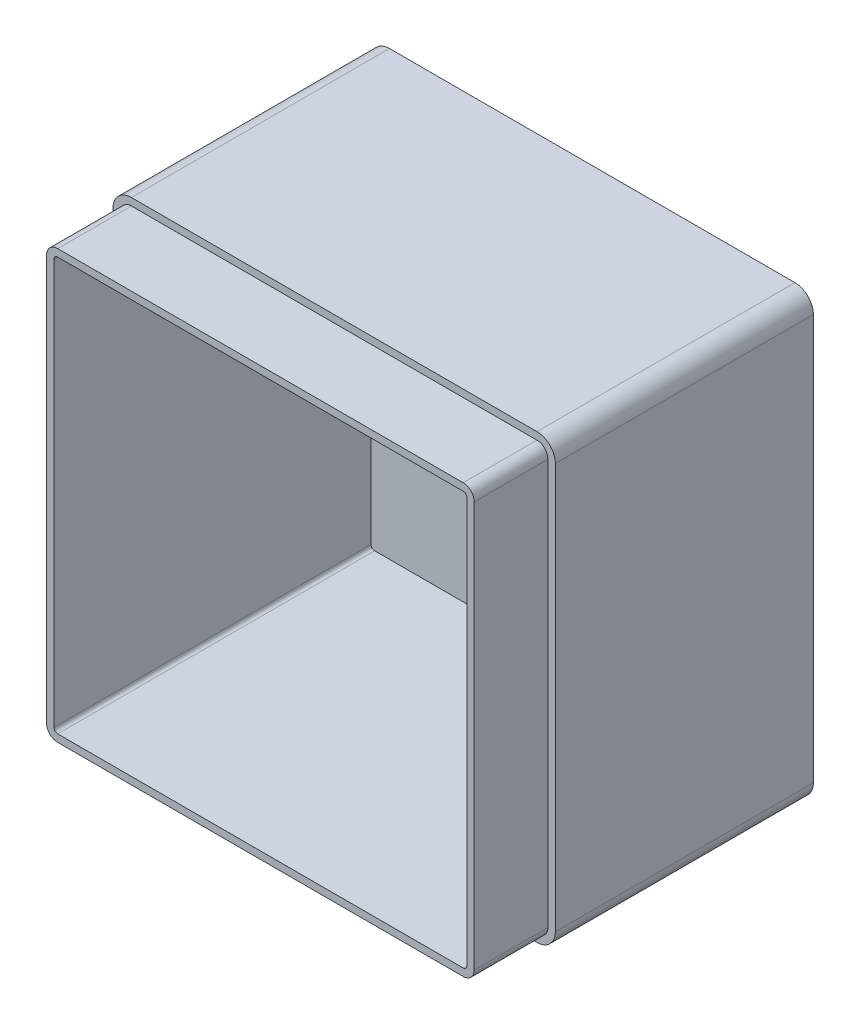
ISO-10303-21;
HEADER;
FILE_DESCRIPTION(('STEP AP214'),'2;1');
FILE_NAME('part.step','',(''),(''),'','','');
FILE_SCHEMA(('AUTOMOTIVE_DESIGN { 1 0 10303 214 1 1 1 1 }'));
ENDSEC;
DATA;
#1=APPLICATION_CONTEXT('core data for automotive mechanical design processes');
#2=APPLICATION_PROTOCOL_DEFINITION('international standard','automotive_design',2000,#1);
#3=PRODUCT_CONTEXT('',#1,'mechanical');
#4=PRODUCT('Part','Part','',(#3));
#5=PRODUCT_RELATED_PRODUCT_CATEGORY('part','',(#4));
#6=PRODUCT_DEFINITION_FORMATION('','',#4);
#7=PRODUCT_DEFINITION_CONTEXT('part definition',#1,'design');
#8=PRODUCT_DEFINITION('design','',#6,#7);
#9=PRODUCT_DEFINITION_SHAPE('','',#8);
#10=(LENGTH_UNIT() NAMED_UNIT(*) SI_UNIT(.MILLI.,.METRE.));
#11=(NAMED_UNIT(*) PLANE_ANGLE_UNIT() SI_UNIT($,.RADIAN.));
#12=(NAMED_UNIT(*) SI_UNIT($,.STERADIAN.) SOLID_ANGLE_UNIT());
#13=UNCERTAINTY_MEASURE_WITH_UNIT(LENGTH_MEASURE(1.E-05),#10,'distance_accuracy_value','');
#14=(GEOMETRIC_REPRESENTATION_CONTEXT(3) GLOBAL_UNCERTAINTY_ASSIGNED_CONTEXT((#13)) GLOBAL_UNIT_ASSIGNED_CONTEXT((#10,
#11,#12)) REPRESENTATION_CONTEXT('',''));
#15=CARTESIAN_POINT('',(0.,0.,0.));
#16=DIRECTION('',(0.,0.,1.));
#17=DIRECTION('',(1.,0.,0.));
#18=AXIS2_PLACEMENT_3D('',#15,#16,#17);
#19=CARTESIAN_POINT('',(0.,0.,90.));
#20=DIRECTION('',(0.,0.,1.));
#21=DIRECTION('',(1.,0.,0.));
#22=AXIS2_PLACEMENT_3D('',#19,#20,#21);
#23=PLANE('',#22);
#24=DIRECTION('',(0.,-1.,0.));
#25=VECTOR('',#24,1.);
#26=CARTESIAN_POINT('',(4.,0.,90.));
#27=LINE('',#26,#25);
#28=CARTESIAN_POINT('',(4.,-4.99999999999999,90.));
#29=VERTEX_POINT('',#28);
#30=CARTESIAN_POINT('',(4.,-115.,90.));
#31=VERTEX_POINT('',#30);
#32=EDGE_CURVE('E304',#29,#31,#27,.T.);
#33=ORIENTED_EDGE('',*,*,#32,.F.);
#34=CARTESIAN_POINT('',(5.,-5.,90.));
#35=DIRECTION('',(0.,0.,1.));
#36=DIRECTION('',(1.,0.,0.));
#37=AXIS2_PLACEMENT_3D('',#34,#35,#36);
#38=CIRCLE('',#37,1.);
#39=CARTESIAN_POINT('',(5.,-4.,90.));
#40=VERTEX_POINT('',#39);
#41=EDGE_CURVE('E333',#40,#29,#38,.T.);
#42=ORIENTED_EDGE('',*,*,#41,.F.);
#43=DIRECTION('',(-1.,0.,0.));
#44=VECTOR('',#43,1.);
#45=CARTESIAN_POINT('',(0.,-4.,90.));
#46=LINE('',#45,#44);
#47=CARTESIAN_POINT('',(115.,-4.,90.));
#48=VERTEX_POINT('',#47);
#49=EDGE_CURVE('E315',#48,#40,#46,.T.);
#50=ORIENTED_EDGE('',*,*,#49,.F.);
#51=CARTESIAN_POINT('',(115.,-5.,90.));
#52=DIRECTION('',(0.,0.,1.));
#53=DIRECTION('',(1.,0.,0.));
#54=AXIS2_PLACEMENT_3D('',#51,#52,#53);
#55=CIRCLE('',#54,1.);
#56=CARTESIAN_POINT('',(116.,-5.,90.));
#57=VERTEX_POINT('',#56);
#58=EDGE_CURVE('E338',#57,#48,#55,.T.);
#59=ORIENTED_EDGE('',*,*,#58,.F.);
#60=DIRECTION('',(0.,1.,0.));
#61=VECTOR('',#60,1.);
#62=CARTESIAN_POINT('',(116.,0.,90.));
#63=LINE('',#62,#61);
#64=CARTESIAN_POINT('',(116.,-115.,90.));
#65=VERTEX_POINT('',#64);
#66=EDGE_CURVE('E336',#65,#57,#63,.T.);
#67=ORIENTED_EDGE('',*,*,#66,.F.);
#68=CARTESIAN_POINT('',(115.,-115.,90.));
#69=DIRECTION('',(0.,0.,1.));
#70=DIRECTION('',(1.,0.,0.));
#71=AXIS2_PLACEMENT_3D('',#68,#69,#70);
#72=CIRCLE('',#71,1.);
#73=CARTESIAN_POINT('',(115.,-116.,90.));
#74=VERTEX_POINT('',#73);
#75=EDGE_CURVE('E289',#74,#65,#72,.T.);
#76=ORIENTED_EDGE('',*,*,#75,.F.);
#77=DIRECTION('',(1.,0.,0.));
#78=VECTOR('',#77,1.);
#79=CARTESIAN_POINT('',(0.,-116.,90.));
#80=LINE('',#79,#78);
#81=CARTESIAN_POINT('',(5.,-116.,90.));
#82=VERTEX_POINT('',#81);
#83=EDGE_CURVE('E331',#82,#74,#80,.T.);
#84=ORIENTED_EDGE('',*,*,#83,.F.);
#85=CARTESIAN_POINT('',(5.,-115.,90.));
#86=DIRECTION('',(0.,0.,1.));
#87=DIRECTION('',(1.,0.,0.));
#88=AXIS2_PLACEMENT_3D('',#85,#86,#87);
#89=CIRCLE('',#88,1.);
#90=EDGE_CURVE('E326',#31,#82,#89,.T.);
#91=ORIENTED_EDGE('',*,*,#90,.F.);
#92=EDGE_LOOP('',(#33,#42,#50,#59,#67,#76,#84,#91));
#93=FACE_BOUND('',#92,.T.);
#94=DIRECTION('',(-1.,0.,0.));
#95=VECTOR('',#94,1.);
#96=CARTESIAN_POINT('',(115.,-2.,90.));
#97=LINE('',#96,#95);
#98=CARTESIAN_POINT('',(115.,-1.99999999999997,90.));
#99=VERTEX_POINT('',#98);
#100=CARTESIAN_POINT('',(5.,-2.00000000000002,90.));
#101=VERTEX_POINT('',#100);
#102=EDGE_CURVE('E221',#99,#101,#97,.T.);
#103=ORIENTED_EDGE('',*,*,#102,.T.);
#104=CARTESIAN_POINT('',(5.,-5.,90.));
#105=DIRECTION('',(0.,0.,1.));
#106=DIRECTION('',(1.,0.,0.));
#107=AXIS2_PLACEMENT_3D('',#104,#105,#106);
#108=CIRCLE('',#107,2.99999999999999);
#109=CARTESIAN_POINT('',(2.,-5.,90.));
#110=VERTEX_POINT('',#109);
#111=EDGE_CURVE('E241',#101,#110,#108,.T.);
#112=ORIENTED_EDGE('',*,*,#111,.T.);
#113=DIRECTION('',(0.,-1.,0.));
#114=VECTOR('',#113,1.);
#115=CARTESIAN_POINT('',(2.,-5.,90.));
#116=LINE('',#115,#114);
#117=CARTESIAN_POINT('',(2.00000000000001,-115.,90.));
#118=VERTEX_POINT('',#117);
#119=EDGE_CURVE('E201',#110,#118,#116,.T.);
#120=ORIENTED_EDGE('',*,*,#119,.T.);
#121=CARTESIAN_POINT('',(5.,-115.,90.));
#122=DIRECTION('',(0.,0.,1.));
#123=DIRECTION('',(1.,0.,0.));
#124=AXIS2_PLACEMENT_3D('',#121,#122,#123);
#125=CIRCLE('',#124,2.99999999999999);
#126=CARTESIAN_POINT('',(5.,-118.,90.));
#127=VERTEX_POINT('',#126);
#128=EDGE_CURVE('E49',#118,#127,#125,.T.);
#129=ORIENTED_EDGE('',*,*,#128,.T.);
#130=DIRECTION('',(1.,0.,0.));
#131=VECTOR('',#130,1.);
#132=CARTESIAN_POINT('',(5.,-118.,90.));
#133=LINE('',#132,#131);
#134=CARTESIAN_POINT('',(115.,-118.,90.));
#135=VERTEX_POINT('',#134);
#136=EDGE_CURVE('E245',#127,#135,#133,.T.);
#137=ORIENTED_EDGE('',*,*,#136,.T.);
#138=CARTESIAN_POINT('',(115.,-115.,90.));
#139=DIRECTION('',(0.,0.,1.));
#140=DIRECTION('',(1.,0.,0.));
#141=AXIS2_PLACEMENT_3D('',#138,#139,#140);
#142=CIRCLE('',#141,3.);
#143=CARTESIAN_POINT('',(118.,-115.,90.));
#144=VERTEX_POINT('',#143);
#145=EDGE_CURVE('E248',#135,#144,#142,.T.);
#146=ORIENTED_EDGE('',*,*,#145,.T.);
#147=DIRECTION('',(0.,1.,0.));
#148=VECTOR('',#147,1.);
#149=CARTESIAN_POINT('',(118.,-115.,90.));
#150=LINE('',#149,#148);
#151=CARTESIAN_POINT('',(118.,-4.99999999999999,90.));
#152=VERTEX_POINT('',#151);
#153=EDGE_CURVE('E251',#144,#152,#150,.T.);
#154=ORIENTED_EDGE('',*,*,#153,.T.);
#155=CARTESIAN_POINT('',(115.,-5.,90.));
#156=DIRECTION('',(0.,0.,1.));
#157=DIRECTION('',(1.,0.,0.));
#158=AXIS2_PLACEMENT_3D('',#155,#156,#157);
#159=CIRCLE('',#158,3.00000000000003);
#160=EDGE_CURVE('E224',#152,#99,#159,.T.);
#161=ORIENTED_EDGE('',*,*,#160,.T.);
#162=EDGE_LOOP('',(#103,#112,#120,#129,#137,#146,#154,#161));
#163=FACE_BOUND('',#162,.T.);
#164=ADVANCED_FACE('F34',(#93,#163),#23,.T.);
#165=CARTESIAN_POINT('',(4.,0.,90.));
#166=DIRECTION('',(1.,0.,0.));
#167=DIRECTION('',(0.,0.,-1.));
#168=AXIS2_PLACEMENT_3D('',#165,#166,#167);
#169=PLANE('',#168);
#170=DIRECTION('',(0.,-1.,0.));
#171=VECTOR('',#170,1.);
#172=CARTESIAN_POINT('',(4.,0.,4.));
#173=LINE('',#172,#171);
#174=CARTESIAN_POINT('',(4.,-4.99999999999999,4.));
#175=VERTEX_POINT('',#174);
#176=CARTESIAN_POINT('',(4.,-115.,4.));
#177=VERTEX_POINT('',#176);
#178=EDGE_CURVE('E283',#175,#177,#173,.T.);
#179=ORIENTED_EDGE('',*,*,#178,.F.);
#180=DIRECTION('',(0.,0.,-1.));
#181=VECTOR('',#180,1.);
#182=CARTESIAN_POINT('',(4.,-4.99999999999999,90.));
#183=LINE('',#182,#181);
#184=EDGE_CURVE('E290',#29,#175,#183,.T.);
#185=ORIENTED_EDGE('',*,*,#184,.F.);
#186=ORIENTED_EDGE('',*,*,#32,.T.);
#187=DIRECTION('',(0.,0.,-1.));
#188=VECTOR('',#187,1.);
#189=CARTESIAN_POINT('',(4.,-115.,90.));
#190=LINE('',#189,#188);
#191=EDGE_CURVE('E287',#177,#31,#190,.F.);
#192=ORIENTED_EDGE('',*,*,#191,.F.);
#193=EDGE_LOOP('',(#179,#185,#186,#192));
#194=FACE_BOUND('',#193,.T.);
#195=ADVANCED_FACE('F426',(#194),#169,.T.);
#196=CARTESIAN_POINT('',(0.,-116.,90.));
#197=DIRECTION('',(0.,1.,0.));
#198=DIRECTION('',(0.,0.,1.));
#199=AXIS2_PLACEMENT_3D('',#196,#197,#198);
#200=PLANE('',#199);
#201=ORIENTED_EDGE('',*,*,#83,.T.);
#202=DIRECTION('',(0.,0.,1.));
#203=VECTOR('',#202,1.);
#204=CARTESIAN_POINT('',(115.,-116.,90.));
#205=LINE('',#204,#203);
#206=CARTESIAN_POINT('',(115.,-116.,4.));
#207=VERTEX_POINT('',#206);
#208=EDGE_CURVE('E313',#207,#74,#205,.T.);
#209=ORIENTED_EDGE('',*,*,#208,.F.);
#210=DIRECTION('',(1.,0.,0.));
#211=VECTOR('',#210,1.);
#212=CARTESIAN_POINT('',(0.,-116.,4.));
#213=LINE('',#212,#211);
#214=CARTESIAN_POINT('',(5.,-116.,4.));
#215=VERTEX_POINT('',#214);
#216=EDGE_CURVE('E286',#215,#207,#213,.T.);
#217=ORIENTED_EDGE('',*,*,#216,.F.);
#218=DIRECTION('',(0.,0.,1.));
#219=VECTOR('',#218,1.);
#220=CARTESIAN_POINT('',(5.,-116.,90.));
#221=LINE('',#220,#219);
#222=EDGE_CURVE('E310',#82,#215,#221,.F.);
#223=ORIENTED_EDGE('',*,*,#222,.F.);
#224=EDGE_LOOP('',(#201,#209,#217,#223));
#225=FACE_BOUND('',#224,.T.);
#226=ADVANCED_FACE('F432',(#225),#200,.T.);
#227=CARTESIAN_POINT('',(116.,0.,90.));
#228=DIRECTION('',(-1.,0.,0.));
#229=DIRECTION('',(0.,-1.,0.));
#230=AXIS2_PLACEMENT_3D('',#227,#228,#229);
#231=PLANE('',#230);
#232=DIRECTION('',(0.,1.,0.));
#233=VECTOR('',#232,1.);
#234=CARTESIAN_POINT('',(116.,0.,4.));
#235=LINE('',#234,#233);
#236=CARTESIAN_POINT('',(116.,-115.,4.));
#237=VERTEX_POINT('',#236);
#238=CARTESIAN_POINT('',(116.,-5.,4.));
#239=VERTEX_POINT('',#238);
#240=EDGE_CURVE('E296',#237,#239,#235,.T.);
#241=ORIENTED_EDGE('',*,*,#240,.F.);
#242=DIRECTION('',(0.,0.,1.));
#243=VECTOR('',#242,1.);
#244=CARTESIAN_POINT('',(116.,-115.,90.));
#245=LINE('',#244,#243);
#246=EDGE_CURVE('E316',#65,#237,#245,.F.);
#247=ORIENTED_EDGE('',*,*,#246,.F.);
#248=ORIENTED_EDGE('',*,*,#66,.T.);
#249=DIRECTION('',(0.,0.,1.));
#250=VECTOR('',#249,1.);
#251=CARTESIAN_POINT('',(116.,-5.,90.));
#252=LINE('',#251,#250);
#253=EDGE_CURVE('E319',#239,#57,#252,.T.);
#254=ORIENTED_EDGE('',*,*,#253,.F.);
#255=EDGE_LOOP('',(#241,#247,#248,#254));
#256=FACE_BOUND('',#255,.T.);
#257=ADVANCED_FACE('F579',(#256),#231,.T.);
#258=CARTESIAN_POINT('',(0.,-4.,90.));
#259=DIRECTION('',(0.,-1.,0.));
#260=DIRECTION('',(0.,0.,-1.));
#261=AXIS2_PLACEMENT_3D('',#258,#259,#260);
#262=PLANE('',#261);
#263=DIRECTION('',(-1.,0.,0.));
#264=VECTOR('',#263,1.);
#265=CARTESIAN_POINT('',(0.,-4.,4.));
#266=LINE('',#265,#264);
#267=CARTESIAN_POINT('',(115.,-4.,4.));
#268=VERTEX_POINT('',#267);
#269=CARTESIAN_POINT('',(5.,-4.,4.));
#270=VERTEX_POINT('',#269);
#271=EDGE_CURVE('E301',#268,#270,#266,.T.);
#272=ORIENTED_EDGE('',*,*,#271,.F.);
#273=DIRECTION('',(0.,0.,-1.));
#274=VECTOR('',#273,1.);
#275=CARTESIAN_POINT('',(115.,-4.,90.));
#276=LINE('',#275,#274);
#277=EDGE_CURVE('E323',#48,#268,#276,.T.);
#278=ORIENTED_EDGE('',*,*,#277,.F.);
#279=ORIENTED_EDGE('',*,*,#49,.T.);
#280=DIRECTION('',(0.,0.,-1.));
#281=VECTOR('',#280,1.);
#282=CARTESIAN_POINT('',(5.,-4.,90.));
#283=LINE('',#282,#281);
#284=EDGE_CURVE('E320',#270,#40,#283,.F.);
#285=ORIENTED_EDGE('',*,*,#284,.F.);
#286=EDGE_LOOP('',(#272,#278,#279,#285));
#287=FACE_BOUND('',#286,.T.);
#288=ADVANCED_FACE('F571',(#287),#262,.T.);
#289=CARTESIAN_POINT('',(0.,0.,4.));
#290=DIRECTION('',(0.,0.,1.));
#291=DIRECTION('',(1.,0.,0.));
#292=AXIS2_PLACEMENT_3D('',#289,#290,#291);
#293=PLANE('',#292);
#294=ORIENTED_EDGE('',*,*,#216,.T.);
#295=CARTESIAN_POINT('',(115.,-115.,4.));
#296=DIRECTION('',(0.,0.,1.));
#297=DIRECTION('',(1.,0.,0.));
#298=AXIS2_PLACEMENT_3D('',#295,#296,#297);
#299=CIRCLE('',#298,1.);
#300=EDGE_CURVE('E306',#237,#207,#299,.F.);
#301=ORIENTED_EDGE('',*,*,#300,.F.);
#302=ORIENTED_EDGE('',*,*,#240,.T.);
#303=CARTESIAN_POINT('',(115.,-5.,4.));
#304=DIRECTION('',(0.,0.,1.));
#305=DIRECTION('',(1.,0.,0.));
#306=AXIS2_PLACEMENT_3D('',#303,#304,#305);
#307=CIRCLE('',#306,1.);
#308=EDGE_CURVE('E300',#268,#239,#307,.F.);
#309=ORIENTED_EDGE('',*,*,#308,.F.);
#310=ORIENTED_EDGE('',*,*,#271,.T.);
#311=CARTESIAN_POINT('',(5.,-5.,4.));
#312=DIRECTION('',(0.,0.,1.));
#313=DIRECTION('',(1.,0.,0.));
#314=AXIS2_PLACEMENT_3D('',#311,#312,#313);
#315=CIRCLE('',#314,1.);
#316=EDGE_CURVE('E298',#175,#270,#315,.F.);
#317=ORIENTED_EDGE('',*,*,#316,.F.);
#318=ORIENTED_EDGE('',*,*,#178,.T.);
#319=CARTESIAN_POINT('',(5.,-115.,4.));
#320=DIRECTION('',(0.,0.,1.));
#321=DIRECTION('',(1.,0.,0.));
#322=AXIS2_PLACEMENT_3D('',#319,#320,#321);
#323=CIRCLE('',#322,1.);
#324=EDGE_CURVE('E293',#215,#177,#323,.F.);
#325=ORIENTED_EDGE('',*,*,#324,.F.);
#326=EDGE_LOOP('',(#294,#301,#302,#309,#310,#317,#318,#325));
#327=FACE_BOUND('',#326,.T.);
#328=ADVANCED_FACE('F563',(#327),#293,.T.);
#329=CARTESIAN_POINT('',(5.,-115.,90.));
#330=DIRECTION('',(0.,0.,-1.));
#331=DIRECTION('',(-1.,0.,0.));
#332=AXIS2_PLACEMENT_3D('',#329,#330,#331);
#333=CYLINDRICAL_SURFACE('',#332,1.);
#334=ORIENTED_EDGE('',*,*,#90,.T.);
#335=ORIENTED_EDGE('',*,*,#222,.T.);
#336=ORIENTED_EDGE('',*,*,#324,.T.);
#337=ORIENTED_EDGE('',*,*,#191,.T.);
#338=EDGE_LOOP('',(#334,#335,#336,#337));
#339=FACE_BOUND('',#338,.T.);
#340=ADVANCED_FACE('F555',(#339),#333,.F.);
#341=CARTESIAN_POINT('',(5.,-5.,90.));
#342=DIRECTION('',(0.,0.,-1.));
#343=DIRECTION('',(-1.,0.,0.));
#344=AXIS2_PLACEMENT_3D('',#341,#342,#343);
#345=CYLINDRICAL_SURFACE('',#344,1.);
#346=ORIENTED_EDGE('',*,*,#41,.T.);
#347=ORIENTED_EDGE('',*,*,#184,.T.);
#348=ORIENTED_EDGE('',*,*,#316,.T.);
#349=ORIENTED_EDGE('',*,*,#284,.T.);
#350=EDGE_LOOP('',(#346,#347,#348,#349));
#351=FACE_BOUND('',#350,.T.);
#352=ADVANCED_FACE('F548',(#351),#345,.F.);
#353=CARTESIAN_POINT('',(115.,-5.,90.));
#354=DIRECTION('',(0.,0.,-1.));
#355=DIRECTION('',(-1.,0.,0.));
#356=AXIS2_PLACEMENT_3D('',#353,#354,#355);
#357=CYLINDRICAL_SURFACE('',#356,1.);
#358=ORIENTED_EDGE('',*,*,#58,.T.);
#359=ORIENTED_EDGE('',*,*,#277,.T.);
#360=ORIENTED_EDGE('',*,*,#308,.T.);
#361=ORIENTED_EDGE('',*,*,#253,.T.);
#362=EDGE_LOOP('',(#358,#359,#360,#361));
#363=FACE_BOUND('',#362,.T.);
#364=ADVANCED_FACE('F541',(#363),#357,.F.);
#365=CARTESIAN_POINT('',(115.,-115.,90.));
#366=DIRECTION('',(0.,0.,-1.));
#367=DIRECTION('',(-1.,0.,0.));
#368=AXIS2_PLACEMENT_3D('',#365,#366,#367);
#369=CYLINDRICAL_SURFACE('',#368,1.);
#370=ORIENTED_EDGE('',*,*,#75,.T.);
#371=ORIENTED_EDGE('',*,*,#246,.T.);
#372=ORIENTED_EDGE('',*,*,#300,.T.);
#373=ORIENTED_EDGE('',*,*,#208,.T.);
#374=EDGE_LOOP('',(#370,#371,#372,#373));
#375=FACE_BOUND('',#374,.T.);
#376=ADVANCED_FACE('F439',(#375),#369,.F.);
#377=CARTESIAN_POINT('',(5.,-5.,70.));
#378=DIRECTION('',(0.,0.,1.));
#379=DIRECTION('',(1.,0.,0.));
#380=AXIS2_PLACEMENT_3D('',#377,#378,#379);
#381=PLANE('',#380);
#382=DIRECTION('',(-1.,0.,0.));
#383=VECTOR('',#382,1.);
#384=CARTESIAN_POINT('',(115.,-2.,70.));
#385=LINE('',#384,#383);
#386=CARTESIAN_POINT('',(115.,-1.99999999999997,70.));
#387=VERTEX_POINT('',#386);
#388=CARTESIAN_POINT('',(5.,-2.00000000000002,70.));
#389=VERTEX_POINT('',#388);
#390=EDGE_CURVE('E207',#387,#389,#385,.T.);
#391=ORIENTED_EDGE('',*,*,#390,.F.);
#392=CARTESIAN_POINT('',(115.,-5.,70.));
#393=DIRECTION('',(0.,0.,1.));
#394=DIRECTION('',(1.,0.,0.));
#395=AXIS2_PLACEMENT_3D('',#392,#393,#394);
#396=CIRCLE('',#395,3.00000000000003);
#397=CARTESIAN_POINT('',(118.,-4.99999999999999,70.));
#398=VERTEX_POINT('',#397);
#399=EDGE_CURVE('E237',#398,#387,#396,.T.);
#400=ORIENTED_EDGE('',*,*,#399,.F.);
#401=DIRECTION('',(0.,1.,0.));
#402=VECTOR('',#401,1.);
#403=CARTESIAN_POINT('',(118.,-115.,70.));
#404=LINE('',#403,#402);
#405=CARTESIAN_POINT('',(118.,-115.,70.));
#406=VERTEX_POINT('',#405);
#407=EDGE_CURVE('E234',#406,#398,#404,.T.);
#408=ORIENTED_EDGE('',*,*,#407,.F.);
#409=CARTESIAN_POINT('',(115.,-115.,70.));
#410=DIRECTION('',(0.,0.,1.));
#411=DIRECTION('',(1.,0.,0.));
#412=AXIS2_PLACEMENT_3D('',#409,#410,#411);
#413=CIRCLE('',#412,3.);
#414=CARTESIAN_POINT('',(115.,-118.,70.));
#415=VERTEX_POINT('',#414);
#416=EDGE_CURVE('E231',#415,#406,#413,.T.);
#417=ORIENTED_EDGE('',*,*,#416,.F.);
#418=DIRECTION('',(1.,0.,0.));
#419=VECTOR('',#418,1.);
#420=CARTESIAN_POINT('',(5.,-118.,70.));
#421=LINE('',#420,#419);
#422=CARTESIAN_POINT('',(5.,-118.,70.));
#423=VERTEX_POINT('',#422);
#424=EDGE_CURVE('E228',#423,#415,#421,.T.);
#425=ORIENTED_EDGE('',*,*,#424,.F.);
#426=CARTESIAN_POINT('',(5.,-115.,70.));
#427=DIRECTION('',(0.,0.,1.));
#428=DIRECTION('',(1.,0.,0.));
#429=AXIS2_PLACEMENT_3D('',#426,#427,#428);
#430=CIRCLE('',#429,2.99999999999999);
#431=CARTESIAN_POINT('',(2.00000000000001,-115.,70.));
#432=VERTEX_POINT('',#431);
#433=EDGE_CURVE('E217',#432,#423,#430,.T.);
#434=ORIENTED_EDGE('',*,*,#433,.F.);
#435=DIRECTION('',(0.,-1.,0.));
#436=VECTOR('',#435,1.);
#437=CARTESIAN_POINT('',(2.,-5.,70.));
#438=LINE('',#437,#436);
#439=CARTESIAN_POINT('',(2.,-5.,70.));
#440=VERTEX_POINT('',#439);
#441=EDGE_CURVE('E199',#440,#432,#438,.T.);
#442=ORIENTED_EDGE('',*,*,#441,.F.);
#443=CARTESIAN_POINT('',(5.,-5.,70.));
#444=DIRECTION('',(0.,0.,1.));
#445=DIRECTION('',(1.,0.,0.));
#446=AXIS2_PLACEMENT_3D('',#443,#444,#445);
#447=CIRCLE('',#446,2.99999999999999);
#448=EDGE_CURVE('E213',#389,#440,#447,.T.);
#449=ORIENTED_EDGE('',*,*,#448,.F.);
#450=EDGE_LOOP('',(#391,#400,#408,#417,#425,#434,#442,#449));
#451=FACE_BOUND('',#450,.T.);
#452=CARTESIAN_POINT('',(5.,-5.,70.));
#453=DIRECTION('',(0.,0.,1.));
#454=DIRECTION('',(1.,0.,0.));
#455=AXIS2_PLACEMENT_3D('',#452,#453,#454);
#456=CIRCLE('',#455,5.);
#457=CARTESIAN_POINT('',(5.,0.,70.));
#458=VERTEX_POINT('',#457);
#459=CARTESIAN_POINT('',(0.,-5.,70.));
#460=VERTEX_POINT('',#459);
#461=EDGE_CURVE('E257',#458,#460,#456,.T.);
#462=ORIENTED_EDGE('',*,*,#461,.T.);
#463=DIRECTION('',(0.,-1.,0.));
#464=VECTOR('',#463,1.);
#465=CARTESIAN_POINT('',(0.,-5.,70.));
#466=LINE('',#465,#464);
#467=CARTESIAN_POINT('',(0.,-115.,70.));
#468=VERTEX_POINT('',#467);
#469=EDGE_CURVE('E270',#460,#468,#466,.T.);
#470=ORIENTED_EDGE('',*,*,#469,.T.);
#471=CARTESIAN_POINT('',(5.,-115.,70.));
#472=DIRECTION('',(0.,0.,1.));
#473=DIRECTION('',(1.,0.,0.));
#474=AXIS2_PLACEMENT_3D('',#471,#472,#473);
#475=CIRCLE('',#474,5.);
#476=CARTESIAN_POINT('',(5.,-120.,70.));
#477=VERTEX_POINT('',#476);
#478=EDGE_CURVE('E272',#468,#477,#475,.T.);
#479=ORIENTED_EDGE('',*,*,#478,.T.);
#480=DIRECTION('',(1.,0.,0.));
#481=VECTOR('',#480,1.);
#482=CARTESIAN_POINT('',(5.,-120.,70.));
#483=LINE('',#482,#481);
#484=CARTESIAN_POINT('',(115.,-120.,70.));
#485=VERTEX_POINT('',#484);
#486=EDGE_CURVE('E57',#477,#485,#483,.T.);
#487=ORIENTED_EDGE('',*,*,#486,.T.);
#488=CARTESIAN_POINT('',(115.,-115.,70.));
#489=DIRECTION('',(0.,0.,1.));
#490=DIRECTION('',(1.,0.,0.));
#491=AXIS2_PLACEMENT_3D('',#488,#489,#490);
#492=CIRCLE('',#491,5.);
#493=CARTESIAN_POINT('',(120.,-115.,70.));
#494=VERTEX_POINT('',#493);
#495=EDGE_CURVE('E275',#485,#494,#492,.T.);
#496=ORIENTED_EDGE('',*,*,#495,.T.);
#497=DIRECTION('',(0.,1.,0.));
#498=VECTOR('',#497,1.);
#499=CARTESIAN_POINT('',(120.,-115.,70.));
#500=LINE('',#499,#498);
#501=CARTESIAN_POINT('',(120.,-4.99999999999999,70.));
#502=VERTEX_POINT('',#501);
#503=EDGE_CURVE('E277',#494,#502,#500,.T.);
#504=ORIENTED_EDGE('',*,*,#503,.T.);
#505=CARTESIAN_POINT('',(115.,-5.,70.));
#506=DIRECTION('',(0.,0.,1.));
#507=DIRECTION('',(1.,0.,0.));
#508=AXIS2_PLACEMENT_3D('',#505,#506,#507);
#509=CIRCLE('',#508,5.);
#510=CARTESIAN_POINT('',(115.,0.,70.));
#511=VERTEX_POINT('',#510);
#512=EDGE_CURVE('E279',#502,#511,#509,.T.);
#513=ORIENTED_EDGE('',*,*,#512,.T.);
#514=DIRECTION('',(-1.,0.,0.));
#515=VECTOR('',#514,1.);
#516=CARTESIAN_POINT('',(115.,0.,70.));
#517=LINE('',#516,#515);
#518=EDGE_CURVE('E281',#511,#458,#517,.T.);
#519=ORIENTED_EDGE('',*,*,#518,.T.);
#520=EDGE_LOOP('',(#462,#470,#479,#487,#496,#504,#513,#519));
#521=FACE_BOUND('',#520,.T.);
#522=ADVANCED_FACE('F212',(#451,#521),#381,.T.);
#523=CARTESIAN_POINT('',(5.,-5.,70.));
#524=DIRECTION('',(0.,0.,1.));
#525=DIRECTION('',(1.,0.,0.));
#526=AXIS2_PLACEMENT_3D('',#523,#524,#525);
#527=CYLINDRICAL_SURFACE('',#526,2.99999999999999);
#528=ORIENTED_EDGE('',*,*,#111,.F.);
#529=DIRECTION('',(0.,0.,1.));
#530=VECTOR('',#529,1.);
#531=CARTESIAN_POINT('',(5.,-2.00000000000002,70.));
#532=LINE('',#531,#530);
#533=EDGE_CURVE('E220',#389,#101,#532,.T.);
#534=ORIENTED_EDGE('',*,*,#533,.F.);
#535=ORIENTED_EDGE('',*,*,#448,.T.);
#536=DIRECTION('',(0.,0.,1.));
#537=VECTOR('',#536,1.);
#538=CARTESIAN_POINT('',(2.,-5.,70.));
#539=LINE('',#538,#537);
#540=EDGE_CURVE('E196',#440,#110,#539,.T.);
#541=ORIENTED_EDGE('',*,*,#540,.T.);
#542=EDGE_LOOP('',(#528,#534,#535,#541));
#543=FACE_BOUND('',#542,.T.);
#544=ADVANCED_FACE('F219',(#543),#527,.T.);
#545=CARTESIAN_POINT('',(115.,-2.,70.));
#546=DIRECTION('',(0.,1.,0.));
#547=DIRECTION('',(-1.,0.,0.));
#548=AXIS2_PLACEMENT_3D('',#545,#546,#547);
#549=PLANE('',#548);
#550=ORIENTED_EDGE('',*,*,#102,.F.);
#551=DIRECTION('',(0.,0.,1.));
#552=VECTOR('',#551,1.);
#553=CARTESIAN_POINT('',(115.,-1.99999999999997,70.));
#554=LINE('',#553,#552);
#555=EDGE_CURVE('E258',#387,#99,#554,.T.);
#556=ORIENTED_EDGE('',*,*,#555,.F.);
#557=ORIENTED_EDGE('',*,*,#390,.T.);
#558=ORIENTED_EDGE('',*,*,#533,.T.);
#559=EDGE_LOOP('',(#550,#556,#557,#558));
#560=FACE_BOUND('',#559,.T.);
#561=ADVANCED_FACE('F514',(#560),#549,.T.);
#562=CARTESIAN_POINT('',(115.,-5.,70.));
#563=DIRECTION('',(0.,0.,1.));
#564=DIRECTION('',(1.,0.,0.));
#565=AXIS2_PLACEMENT_3D('',#562,#563,#564);
#566=CYLINDRICAL_SURFACE('',#565,3.00000000000003);
#567=ORIENTED_EDGE('',*,*,#160,.F.);
#568=DIRECTION('',(0.,0.,1.));
#569=VECTOR('',#568,1.);
#570=CARTESIAN_POINT('',(118.,-4.99999999999999,70.));
#571=LINE('',#570,#569);
#572=EDGE_CURVE('E260',#398,#152,#571,.T.);
#573=ORIENTED_EDGE('',*,*,#572,.F.);
#574=ORIENTED_EDGE('',*,*,#399,.T.);
#575=ORIENTED_EDGE('',*,*,#555,.T.);
#576=EDGE_LOOP('',(#567,#573,#574,#575));
#577=FACE_BOUND('',#576,.T.);
#578=ADVANCED_FACE('F506',(#577),#566,.T.);
#579=CARTESIAN_POINT('',(118.,-115.,70.));
#580=DIRECTION('',(1.,0.,0.));
#581=DIRECTION('',(0.,0.,-1.));
#582=AXIS2_PLACEMENT_3D('',#579,#580,#581);
#583=PLANE('',#582);
#584=ORIENTED_EDGE('',*,*,#153,.F.);
#585=DIRECTION('',(0.,0.,1.));
#586=VECTOR('',#585,1.);
#587=CARTESIAN_POINT('',(118.,-115.,70.));
#588=LINE('',#587,#586);
#589=EDGE_CURVE('E262',#406,#144,#588,.T.);
#590=ORIENTED_EDGE('',*,*,#589,.F.);
#591=ORIENTED_EDGE('',*,*,#407,.T.);
#592=ORIENTED_EDGE('',*,*,#572,.T.);
#593=EDGE_LOOP('',(#584,#590,#591,#592));
#594=FACE_BOUND('',#593,.T.);
#595=ADVANCED_FACE('F498',(#594),#583,.T.);
#596=CARTESIAN_POINT('',(115.,-115.,70.));
#597=DIRECTION('',(0.,0.,1.));
#598=DIRECTION('',(1.,0.,0.));
#599=AXIS2_PLACEMENT_3D('',#596,#597,#598);
#600=CYLINDRICAL_SURFACE('',#599,3.);
#601=ORIENTED_EDGE('',*,*,#145,.F.);
#602=DIRECTION('',(0.,0.,1.));
#603=VECTOR('',#602,1.);
#604=CARTESIAN_POINT('',(115.,-118.,70.));
#605=LINE('',#604,#603);
#606=EDGE_CURVE('E264',#415,#135,#605,.T.);
#607=ORIENTED_EDGE('',*,*,#606,.F.);
#608=ORIENTED_EDGE('',*,*,#416,.T.);
#609=ORIENTED_EDGE('',*,*,#589,.T.);
#610=EDGE_LOOP('',(#601,#607,#608,#609));
#611=FACE_BOUND('',#610,.T.);
#612=ADVANCED_FACE('F490',(#611),#600,.T.);
#613=CARTESIAN_POINT('',(5.,-118.,70.));
#614=DIRECTION('',(0.,-1.,0.));
#615=DIRECTION('',(0.,0.,-1.));
#616=AXIS2_PLACEMENT_3D('',#613,#614,#615);
#617=PLANE('',#616);
#618=ORIENTED_EDGE('',*,*,#136,.F.);
#619=DIRECTION('',(0.,0.,1.));
#620=VECTOR('',#619,1.);
#621=CARTESIAN_POINT('',(5.,-118.,70.));
#622=LINE('',#621,#620);
#623=EDGE_CURVE('E266',#423,#127,#622,.T.);
#624=ORIENTED_EDGE('',*,*,#623,.F.);
#625=ORIENTED_EDGE('',*,*,#424,.T.);
#626=ORIENTED_EDGE('',*,*,#606,.T.);
#627=EDGE_LOOP('',(#618,#624,#625,#626));
#628=FACE_BOUND('',#627,.T.);
#629=ADVANCED_FACE('F483',(#628),#617,.T.);
#630=CARTESIAN_POINT('',(5.,-115.,70.));
#631=DIRECTION('',(0.,0.,1.));
#632=DIRECTION('',(1.,0.,0.));
#633=AXIS2_PLACEMENT_3D('',#630,#631,#632);
#634=CYLINDRICAL_SURFACE('',#633,2.99999999999999);
#635=ORIENTED_EDGE('',*,*,#128,.F.);
#636=DIRECTION('',(0.,0.,1.));
#637=VECTOR('',#636,1.);
#638=CARTESIAN_POINT('',(2.00000000000001,-115.,70.));
#639=LINE('',#638,#637);
#640=EDGE_CURVE('E206',#432,#118,#639,.T.);
#641=ORIENTED_EDGE('',*,*,#640,.F.);
#642=ORIENTED_EDGE('',*,*,#433,.T.);
#643=ORIENTED_EDGE('',*,*,#623,.T.);
#644=EDGE_LOOP('',(#635,#641,#642,#643));
#645=FACE_BOUND('',#644,.T.);
#646=ADVANCED_FACE('F476',(#645),#634,.T.);
#647=CARTESIAN_POINT('',(2.,-5.,70.));
#648=DIRECTION('',(-1.,0.,0.));
#649=DIRECTION('',(0.,-1.,0.));
#650=AXIS2_PLACEMENT_3D('',#647,#648,#649);
#651=PLANE('',#650);
#652=ORIENTED_EDGE('',*,*,#119,.F.);
#653=ORIENTED_EDGE('',*,*,#540,.F.);
#654=ORIENTED_EDGE('',*,*,#441,.T.);
#655=ORIENTED_EDGE('',*,*,#640,.T.);
#656=EDGE_LOOP('',(#652,#653,#654,#655));
#657=FACE_BOUND('',#656,.T.);
#658=ADVANCED_FACE('F198',(#657),#651,.T.);
#659=CARTESIAN_POINT('',(0.,0.,0.));
#660=DIRECTION('',(0.,0.,1.));
#661=DIRECTION('',(1.,0.,0.));
#662=AXIS2_PLACEMENT_3D('',#659,#660,#661);
#663=PLANE('',#662);
#664=DIRECTION('',(1.,0.,0.));
#665=VECTOR('',#664,1.);
#666=CARTESIAN_POINT('',(0.,-120.,0.));
#667=LINE('',#666,#665);
#668=CARTESIAN_POINT('',(5.,-120.,0.));
#669=VERTEX_POINT('',#668);
#670=CARTESIAN_POINT('',(115.,-120.,0.));
#671=VERTEX_POINT('',#670);
#672=EDGE_CURVE('E346',#669,#671,#667,.T.);
#673=ORIENTED_EDGE('',*,*,#672,.F.);
#674=CARTESIAN_POINT('',(5.,-115.,0.));
#675=DIRECTION('',(0.,0.,1.));
#676=DIRECTION('',(1.,0.,0.));
#677=AXIS2_PLACEMENT_3D('',#674,#675,#676);
#678=CIRCLE('',#677,5.);
#679=CARTESIAN_POINT('',(0.,-115.,0.));
#680=VERTEX_POINT('',#679);
#681=EDGE_CURVE('E366',#669,#680,#678,.F.);
#682=ORIENTED_EDGE('',*,*,#681,.T.);
#683=DIRECTION('',(0.,-1.,0.));
#684=VECTOR('',#683,1.);
#685=CARTESIAN_POINT('',(0.,0.,0.));
#686=LINE('',#685,#684);
#687=CARTESIAN_POINT('',(0.,-5.,0.));
#688=VERTEX_POINT('',#687);
#689=EDGE_CURVE('E322',#688,#680,#686,.T.);
#690=ORIENTED_EDGE('',*,*,#689,.F.);
#691=CARTESIAN_POINT('',(5.,-5.,0.));
#692=DIRECTION('',(0.,0.,1.));
#693=DIRECTION('',(1.,0.,0.));
#694=AXIS2_PLACEMENT_3D('',#691,#692,#693);
#695=CIRCLE('',#694,5.);
#696=CARTESIAN_POINT('',(5.,0.,0.));
#697=VERTEX_POINT('',#696);
#698=EDGE_CURVE('E364',#688,#697,#695,.F.);
#699=ORIENTED_EDGE('',*,*,#698,.T.);
#700=DIRECTION('',(-1.,0.,0.));
#701=VECTOR('',#700,1.);
#702=CARTESIAN_POINT('',(0.,0.,0.));
#703=LINE('',#702,#701);
#704=CARTESIAN_POINT('',(115.,0.,0.));
#705=VERTEX_POINT('',#704);
#706=EDGE_CURVE('E352',#705,#697,#703,.T.);
#707=ORIENTED_EDGE('',*,*,#706,.F.);
#708=CARTESIAN_POINT('',(115.,-5.,0.));
#709=DIRECTION('',(0.,0.,1.));
#710=DIRECTION('',(1.,0.,0.));
#711=AXIS2_PLACEMENT_3D('',#708,#709,#710);
#712=CIRCLE('',#711,5.);
#713=CARTESIAN_POINT('',(120.,-4.99999999999999,0.));
#714=VERTEX_POINT('',#713);
#715=EDGE_CURVE('E362',#705,#714,#712,.F.);
#716=ORIENTED_EDGE('',*,*,#715,.T.);
#717=DIRECTION('',(0.,1.,0.));
#718=VECTOR('',#717,1.);
#719=CARTESIAN_POINT('',(120.,0.,0.));
#720=LINE('',#719,#718);
#721=CARTESIAN_POINT('',(120.,-115.,0.));
#722=VERTEX_POINT('',#721);
#723=EDGE_CURVE('E349',#722,#714,#720,.T.);
#724=ORIENTED_EDGE('',*,*,#723,.F.);
#725=CARTESIAN_POINT('',(115.,-115.,0.));
#726=DIRECTION('',(0.,0.,1.));
#727=DIRECTION('',(1.,0.,0.));
#728=AXIS2_PLACEMENT_3D('',#725,#726,#727);
#729=CIRCLE('',#728,5.);
#730=EDGE_CURVE('E360',#722,#671,#729,.F.);
#731=ORIENTED_EDGE('',*,*,#730,.T.);
#732=EDGE_LOOP('',(#673,#682,#690,#699,#707,#716,#724,#731));
#733=FACE_BOUND('',#732,.T.);
#734=ADVANCED_FACE('F388',(#733),#663,.F.);
#735=CARTESIAN_POINT('',(5.,-5.,90.));
#736=DIRECTION('',(0.,0.,-1.));
#737=DIRECTION('',(-1.,0.,0.));
#738=AXIS2_PLACEMENT_3D('',#735,#736,#737);
#739=CYLINDRICAL_SURFACE('',#738,5.);
#740=DIRECTION('',(0.,0.,-1.));
#741=VECTOR('',#740,1.);
#742=CARTESIAN_POINT('',(0.,-5.,90.));
#743=LINE('',#742,#741);
#744=EDGE_CURVE('E368',#460,#688,#743,.T.);
#745=ORIENTED_EDGE('',*,*,#744,.F.);
#746=ORIENTED_EDGE('',*,*,#461,.F.);
#747=DIRECTION('',(0.,0.,-1.));
#748=VECTOR('',#747,1.);
#749=CARTESIAN_POINT('',(5.,0.,90.));
#750=LINE('',#749,#748);
#751=EDGE_CURVE('E375',#697,#458,#750,.F.);
#752=ORIENTED_EDGE('',*,*,#751,.F.);
#753=ORIENTED_EDGE('',*,*,#698,.F.);
#754=EDGE_LOOP('',(#745,#746,#752,#753));
#755=FACE_BOUND('',#754,.T.);
#756=ADVANCED_FACE('F403',(#755),#739,.T.);
#757=CARTESIAN_POINT('',(115.,-5.,90.));
#758=DIRECTION('',(0.,0.,-1.));
#759=DIRECTION('',(-1.,0.,0.));
#760=AXIS2_PLACEMENT_3D('',#757,#758,#759);
#761=CYLINDRICAL_SURFACE('',#760,5.);
#762=DIRECTION('',(0.,0.,-1.));
#763=VECTOR('',#762,1.);
#764=CARTESIAN_POINT('',(115.,0.,90.));
#765=LINE('',#764,#763);
#766=EDGE_CURVE('E373',#511,#705,#765,.T.);
#767=ORIENTED_EDGE('',*,*,#766,.F.);
#768=ORIENTED_EDGE('',*,*,#512,.F.);
#769=DIRECTION('',(0.,0.,-1.));
#770=VECTOR('',#769,1.);
#771=CARTESIAN_POINT('',(120.,-5.,90.));
#772=LINE('',#771,#770);
#773=EDGE_CURVE('E11',#714,#502,#772,.F.);
#774=ORIENTED_EDGE('',*,*,#773,.F.);
#775=ORIENTED_EDGE('',*,*,#715,.F.);
#776=EDGE_LOOP('',(#767,#768,#774,#775));
#777=FACE_BOUND('',#776,.T.);
#778=ADVANCED_FACE('F393',(#777),#761,.T.);
#779=CARTESIAN_POINT('',(0.,0.,90.));
#780=DIRECTION('',(0.,-1.,0.));
#781=DIRECTION('',(0.,0.,-1.));
#782=AXIS2_PLACEMENT_3D('',#779,#780,#781);
#783=PLANE('',#782);
#784=ORIENTED_EDGE('',*,*,#518,.F.);
#785=ORIENTED_EDGE('',*,*,#766,.T.);
#786=ORIENTED_EDGE('',*,*,#706,.T.);
#787=ORIENTED_EDGE('',*,*,#751,.T.);
#788=EDGE_LOOP('',(#784,#785,#786,#787));
#789=FACE_BOUND('',#788,.T.);
#790=ADVANCED_FACE('F398',(#789),#783,.F.);
#791=CARTESIAN_POINT('',(115.,-115.,90.));
#792=DIRECTION('',(0.,0.,-1.));
#793=DIRECTION('',(-1.,0.,0.));
#794=AXIS2_PLACEMENT_3D('',#791,#792,#793);
#795=CYLINDRICAL_SURFACE('',#794,5.);
#796=DIRECTION('',(0.,0.,-1.));
#797=VECTOR('',#796,1.);
#798=CARTESIAN_POINT('',(120.,-115.,90.));
#799=LINE('',#798,#797);
#800=EDGE_CURVE('E42',#494,#722,#799,.T.);
#801=ORIENTED_EDGE('',*,*,#800,.F.);
#802=ORIENTED_EDGE('',*,*,#495,.F.);
#803=DIRECTION('',(0.,0.,-1.));
#804=VECTOR('',#803,1.);
#805=CARTESIAN_POINT('',(115.,-120.,90.));
#806=LINE('',#805,#804);
#807=EDGE_CURVE('E355',#671,#485,#806,.F.);
#808=ORIENTED_EDGE('',*,*,#807,.F.);
#809=ORIENTED_EDGE('',*,*,#730,.F.);
#810=EDGE_LOOP('',(#801,#802,#808,#809));
#811=FACE_BOUND('',#810,.T.);
#812=ADVANCED_FACE('F36',(#811),#795,.T.);
#813=CARTESIAN_POINT('',(120.,0.,90.));
#814=DIRECTION('',(-1.,0.,0.));
#815=DIRECTION('',(0.,-1.,0.));
#816=AXIS2_PLACEMENT_3D('',#813,#814,#815);
#817=PLANE('',#816);
#818=ORIENTED_EDGE('',*,*,#503,.F.);
#819=ORIENTED_EDGE('',*,*,#800,.T.);
#820=ORIENTED_EDGE('',*,*,#723,.T.);
#821=ORIENTED_EDGE('',*,*,#773,.T.);
#822=EDGE_LOOP('',(#818,#819,#820,#821));
#823=FACE_BOUND('',#822,.T.);
#824=ADVANCED_FACE('F381',(#823),#817,.F.);
#825=CARTESIAN_POINT('',(5.,-115.,90.));
#826=DIRECTION('',(0.,0.,-1.));
#827=DIRECTION('',(-1.,0.,0.));
#828=AXIS2_PLACEMENT_3D('',#825,#826,#827);
#829=CYLINDRICAL_SURFACE('',#828,5.);
#830=DIRECTION('',(0.,0.,-1.));
#831=VECTOR('',#830,1.);
#832=CARTESIAN_POINT('',(5.,-120.,90.));
#833=LINE('',#832,#831);
#834=EDGE_CURVE('E358',#477,#669,#833,.T.);
#835=ORIENTED_EDGE('',*,*,#834,.F.);
#836=ORIENTED_EDGE('',*,*,#478,.F.);
#837=DIRECTION('',(0.,0.,-1.));
#838=VECTOR('',#837,1.);
#839=CARTESIAN_POINT('',(0.,-115.,90.));
#840=LINE('',#839,#838);
#841=EDGE_CURVE('E370',#680,#468,#840,.F.);
#842=ORIENTED_EDGE('',*,*,#841,.F.);
#843=ORIENTED_EDGE('',*,*,#681,.F.);
#844=EDGE_LOOP('',(#835,#836,#842,#843));
#845=FACE_BOUND('',#844,.T.);
#846=ADVANCED_FACE('F413',(#845),#829,.T.);
#847=CARTESIAN_POINT('',(0.,-120.,90.));
#848=DIRECTION('',(0.,1.,0.));
#849=DIRECTION('',(0.,0.,1.));
#850=AXIS2_PLACEMENT_3D('',#847,#848,#849);
#851=PLANE('',#850);
#852=ORIENTED_EDGE('',*,*,#486,.F.);
#853=ORIENTED_EDGE('',*,*,#834,.T.);
#854=ORIENTED_EDGE('',*,*,#672,.T.);
#855=ORIENTED_EDGE('',*,*,#807,.T.);
#856=EDGE_LOOP('',(#852,#853,#854,#855));
#857=FACE_BOUND('',#856,.T.);
#858=ADVANCED_FACE('F415',(#857),#851,.F.);
#859=CARTESIAN_POINT('',(0.,0.,90.));
#860=DIRECTION('',(1.,0.,0.));
#861=DIRECTION('',(0.,0.,-1.));
#862=AXIS2_PLACEMENT_3D('',#859,#860,#861);
#863=PLANE('',#862);
#864=ORIENTED_EDGE('',*,*,#469,.F.);
#865=ORIENTED_EDGE('',*,*,#744,.T.);
#866=ORIENTED_EDGE('',*,*,#689,.T.);
#867=ORIENTED_EDGE('',*,*,#841,.T.);
#868=EDGE_LOOP('',(#864,#865,#866,#867));
#869=FACE_BOUND('',#868,.T.);
#870=ADVANCED_FACE('F408',(#869),#863,.F.);
#871=CLOSED_SHELL('',(#164,#195,#226,#257,#288,#328,#340,#352,#364,#376,#522,#544,#561,#578,
#595,#612,#629,#646,#658,#734,#756,#778,#790,#812,#824,#846,#858,#870));
#872=MANIFOLD_SOLID_BREP('B2',#871);
#873=ADVANCED_BREP_SHAPE_REPRESENTATION('',(#18,#872),#14);
#874=SHAPE_DEFINITION_REPRESENTATION(#9,#873);
ENDSEC;
END-ISO-10303-21;
